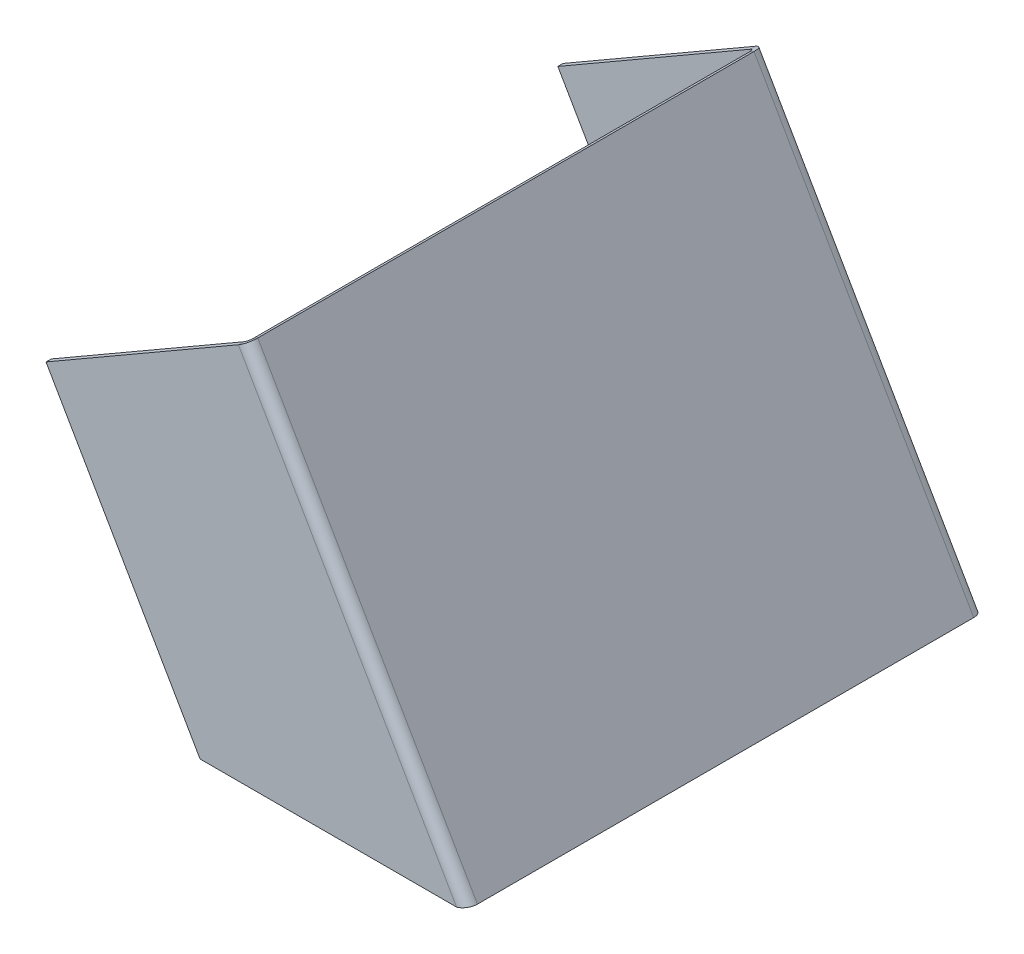
ISO-10303-21;
HEADER;
FILE_DESCRIPTION(('STEP AP214'),'2;1');
FILE_NAME('part.step','',(''),(''),'','','');
FILE_SCHEMA(('AUTOMOTIVE_DESIGN { 1 0 10303 214 1 1 1 1 }'));
ENDSEC;
DATA;
#1=APPLICATION_CONTEXT('core data for automotive mechanical design processes');
#2=APPLICATION_PROTOCOL_DEFINITION('international standard','automotive_design',2000,#1);
#3=PRODUCT_CONTEXT('',#1,'mechanical');
#4=PRODUCT('Part','Part','',(#3));
#5=PRODUCT_RELATED_PRODUCT_CATEGORY('part','',(#4));
#6=PRODUCT_DEFINITION_FORMATION('','',#4);
#7=PRODUCT_DEFINITION_CONTEXT('part definition',#1,'design');
#8=PRODUCT_DEFINITION('design','',#6,#7);
#9=PRODUCT_DEFINITION_SHAPE('','',#8);
#10=(LENGTH_UNIT() NAMED_UNIT(*) SI_UNIT(.MILLI.,.METRE.));
#11=(NAMED_UNIT(*) PLANE_ANGLE_UNIT() SI_UNIT($,.RADIAN.));
#12=(NAMED_UNIT(*) SI_UNIT($,.STERADIAN.) SOLID_ANGLE_UNIT());
#13=UNCERTAINTY_MEASURE_WITH_UNIT(LENGTH_MEASURE(1.E-05),#10,'distance_accuracy_value','');
#14=(GEOMETRIC_REPRESENTATION_CONTEXT(3) GLOBAL_UNCERTAINTY_ASSIGNED_CONTEXT((#13)) GLOBAL_UNIT_ASSIGNED_CONTEXT((#10,
#11,#12)) REPRESENTATION_CONTEXT('',''));
#15=CARTESIAN_POINT('',(0.,0.,0.));
#16=DIRECTION('',(0.,0.,1.));
#17=DIRECTION('',(1.,0.,0.));
#18=AXIS2_PLACEMENT_3D('',#15,#16,#17);
#19=CARTESIAN_POINT('',(-479.416697508022,3129.49491924311,97.5));
#20=DIRECTION('',(-0.866025403784441,-0.499999999999996,0.));
#21=DIRECTION('',(-0.499999999999996,0.866025403784441,0.));
#22=AXIS2_PLACEMENT_3D('',#19,#20,#21);
#23=PLANE('',#22);
#24=DIRECTION('',(0.,0.,-1.));
#25=VECTOR('',#24,1.);
#26=CARTESIAN_POINT('',(-520.122824862242,3199.99999999999,97.5));
#27=LINE('',#26,#25);
#28=CARTESIAN_POINT('',(-520.122824862242,3199.99999999999,99.5));
#29=VERTEX_POINT('',#28);
#30=CARTESIAN_POINT('',(-520.122824862242,3199.99999999999,97.5));
#31=VERTEX_POINT('',#30);
#32=EDGE_CURVE('E11',#29,#31,#27,.T.);
#33=ORIENTED_EDGE('',*,*,#32,.F.);
#34=DIRECTION('',(-0.499999999999996,0.866025403784441,0.));
#35=VECTOR('',#34,1.);
#36=CARTESIAN_POINT('',(-479.416697508022,3129.49491924311,99.5));
#37=LINE('',#36,#35);
#38=CARTESIAN_POINT('',(-579.416697508022,3302.7,99.5));
#39=VERTEX_POINT('',#38);
#40=EDGE_CURVE('E134',#29,#39,#37,.T.);
#41=ORIENTED_EDGE('',*,*,#40,.T.);
#42=DIRECTION('',(0.,0.,-1.));
#43=VECTOR('',#42,1.);
#44=CARTESIAN_POINT('',(-579.416697508022,3302.7,97.5));
#45=LINE('',#44,#43);
#46=CARTESIAN_POINT('',(-579.416697508022,3302.7,97.5));
#47=VERTEX_POINT('',#46);
#48=EDGE_CURVE('E50',#39,#47,#45,.T.);
#49=ORIENTED_EDGE('',*,*,#48,.T.);
#50=DIRECTION('',(-0.499999999999996,0.866025403784441,0.));
#51=VECTOR('',#50,1.);
#52=CARTESIAN_POINT('',(-479.416697508022,3129.49491924311,97.5));
#53=LINE('',#52,#51);
#54=EDGE_CURVE('E195',#31,#47,#53,.T.);
#55=ORIENTED_EDGE('',*,*,#54,.F.);
#56=EDGE_LOOP('',(#33,#41,#49,#55));
#57=FACE_BOUND('',#56,.T.);
#58=ADVANCED_FACE('F40',(#57),#23,.T.);
#59=CARTESIAN_POINT('',(-501.907423869314,3347.45,97.5));
#60=DIRECTION('',(-0.499999999999996,0.866025403784441,0.));
#61=DIRECTION('',(0.866025403784441,0.499999999999996,0.));
#62=AXIS2_PLACEMENT_3D('',#59,#60,#61);
#63=PLANE('',#62);
#64=ORIENTED_EDGE('',*,*,#48,.F.);
#65=DIRECTION('',(0.866025403784441,0.499999999999996,0.));
#66=VECTOR('',#65,1.);
#67=CARTESIAN_POINT('',(-501.907423869314,3347.45,99.5));
#68=LINE('',#67,#66);
#69=CARTESIAN_POINT('',(-505.371525484452,3345.45,99.5));
#70=VERTEX_POINT('',#69);
#71=EDGE_CURVE('E139',#70,#39,#68,.F.);
#72=ORIENTED_EDGE('',*,*,#71,.F.);
#73=DIRECTION('',(0.,0.,-1.));
#74=VECTOR('',#73,1.);
#75=CARTESIAN_POINT('',(-505.371525484452,3345.45,97.5));
#76=LINE('',#75,#74);
#77=CARTESIAN_POINT('',(-505.371525484452,3345.45,97.5));
#78=VERTEX_POINT('',#77);
#79=EDGE_CURVE('E58',#70,#78,#76,.T.);
#80=ORIENTED_EDGE('',*,*,#79,.T.);
#81=DIRECTION('',(0.866025403784441,0.499999999999996,0.));
#82=VECTOR('',#81,1.);
#83=CARTESIAN_POINT('',(-501.907423869314,3347.45,97.5));
#84=LINE('',#83,#82);
#85=EDGE_CURVE('E198',#78,#47,#84,.F.);
#86=ORIENTED_EDGE('',*,*,#85,.T.);
#87=EDGE_LOOP('',(#64,#72,#80,#86));
#88=FACE_BOUND('',#87,.T.);
#89=ADVANCED_FACE('F201',(#88),#63,.T.);
#90=CARTESIAN_POINT('',(-505.371525484452,3345.45,95.5));
#91=DIRECTION('',(0.499999999999996,-0.866025403784441,0.));
#92=DIRECTION('',(0.866025403784441,0.499999999999996,0.));
#93=AXIS2_PLACEMENT_3D('',#90,#91,#92);
#94=PLANE('',#93);
#95=ORIENTED_EDGE('',*,*,#79,.F.);
#96=CARTESIAN_POINT('',(-505.371525484452,3345.45,95.5));
#97=DIRECTION('',(-0.499999999999996,0.866025403784441,0.));
#98=DIRECTION('',(-0.866025403784441,-0.499999999999996,0.));
#99=AXIS2_PLACEMENT_3D('',#96,#97,#98);
#100=CIRCLE('',#99,4.);
#101=CARTESIAN_POINT('',(-501.907423869314,3347.45,95.5));
#102=VERTEX_POINT('',#101);
#103=EDGE_CURVE('E128',#102,#70,#100,.F.);
#104=ORIENTED_EDGE('',*,*,#103,.F.);
#105=DIRECTION('',(-0.866025403784441,-0.499999999999996,0.));
#106=VECTOR('',#105,1.);
#107=CARTESIAN_POINT('',(-503.639474676883,3346.45,95.5));
#108=LINE('',#107,#106);
#109=CARTESIAN_POINT('',(-503.639474676883,3346.45,95.5));
#110=VERTEX_POINT('',#109);
#111=EDGE_CURVE('E190',#102,#110,#108,.T.);
#112=ORIENTED_EDGE('',*,*,#111,.T.);
#113=CARTESIAN_POINT('',(-505.371525484452,3345.45,95.5));
#114=DIRECTION('',(-0.499999999999996,0.866025403784441,0.));
#115=DIRECTION('',(0.866025403784441,0.499999999999996,0.));
#116=AXIS2_PLACEMENT_3D('',#113,#114,#115);
#117=CIRCLE('',#116,2.);
#118=EDGE_CURVE('E117',#110,#78,#117,.F.);
#119=ORIENTED_EDGE('',*,*,#118,.T.);
#120=EDGE_LOOP('',(#95,#104,#112,#119));
#121=FACE_BOUND('',#120,.T.);
#122=ADVANCED_FACE('F229',(#121),#94,.F.);
#123=CARTESIAN_POINT('',(-503.639474676883,3346.45,-99.5));
#124=DIRECTION('',(-0.499999999999996,0.866025403784441,0.));
#125=DIRECTION('',(0.,0.,-1.));
#126=AXIS2_PLACEMENT_3D('',#123,#124,#125);
#127=PLANE('',#126);
#128=ORIENTED_EDGE('',*,*,#111,.F.);
#129=DIRECTION('',(0.,0.,1.));
#130=VECTOR('',#129,1.);
#131=CARTESIAN_POINT('',(-501.907423869314,3347.45,-99.5));
#132=LINE('',#131,#130);
#133=CARTESIAN_POINT('',(-501.907423869314,3347.45,-95.5));
#134=VERTEX_POINT('',#133);
#135=EDGE_CURVE('E156',#134,#102,#132,.T.);
#136=ORIENTED_EDGE('',*,*,#135,.F.);
#137=DIRECTION('',(-0.866025403784443,-0.499999999999993,0.));
#138=VECTOR('',#137,1.);
#139=CARTESIAN_POINT('',(-503.639474676883,3346.45,-95.5));
#140=LINE('',#139,#138);
#141=CARTESIAN_POINT('',(-503.639474676883,3346.45,-95.5));
#142=VERTEX_POINT('',#141);
#143=EDGE_CURVE('E187',#134,#142,#140,.T.);
#144=ORIENTED_EDGE('',*,*,#143,.T.);
#145=DIRECTION('',(0.,0.,-1.));
#146=VECTOR('',#145,1.);
#147=CARTESIAN_POINT('',(-503.639474676883,3346.45,-99.5));
#148=LINE('',#147,#146);
#149=EDGE_CURVE('E226',#142,#110,#148,.F.);
#150=ORIENTED_EDGE('',*,*,#149,.T.);
#151=EDGE_LOOP('',(#128,#136,#144,#150));
#152=FACE_BOUND('',#151,.T.);
#153=ADVANCED_FACE('F221',(#152),#127,.T.);
#154=CARTESIAN_POINT('',(-505.371525484452,3345.45,-95.5));
#155=DIRECTION('',(0.499999999999996,-0.866025403784441,0.));
#156=DIRECTION('',(0.866025403784441,0.499999999999996,0.));
#157=AXIS2_PLACEMENT_3D('',#154,#155,#156);
#158=PLANE('',#157);
#159=ORIENTED_EDGE('',*,*,#143,.F.);
#160=CARTESIAN_POINT('',(-505.371525484452,3345.45,-95.5));
#161=DIRECTION('',(-0.499999999999996,0.866025403784441,0.));
#162=DIRECTION('',(-0.866025403784441,-0.499999999999996,0.));
#163=AXIS2_PLACEMENT_3D('',#160,#161,#162);
#164=CIRCLE('',#163,4.);
#165=CARTESIAN_POINT('',(-505.371525484452,3345.45,-99.5));
#166=VERTEX_POINT('',#165);
#167=EDGE_CURVE('E131',#166,#134,#164,.F.);
#168=ORIENTED_EDGE('',*,*,#167,.F.);
#169=DIRECTION('',(0.,0.,1.));
#170=VECTOR('',#169,1.);
#171=CARTESIAN_POINT('',(-505.371525484452,3345.45,-97.5));
#172=LINE('',#171,#170);
#173=CARTESIAN_POINT('',(-505.371525484452,3345.45,-97.5));
#174=VERTEX_POINT('',#173);
#175=EDGE_CURVE('E184',#166,#174,#172,.T.);
#176=ORIENTED_EDGE('',*,*,#175,.T.);
#177=CARTESIAN_POINT('',(-505.371525484452,3345.45,-95.5));
#178=DIRECTION('',(-0.499999999999996,0.866025403784441,0.));
#179=DIRECTION('',(0.866025403784441,0.499999999999996,0.));
#180=AXIS2_PLACEMENT_3D('',#177,#178,#179);
#181=CIRCLE('',#180,2.);
#182=EDGE_CURVE('E281',#174,#142,#181,.F.);
#183=ORIENTED_EDGE('',*,*,#182,.T.);
#184=EDGE_LOOP('',(#159,#168,#176,#183));
#185=FACE_BOUND('',#184,.T.);
#186=ADVANCED_FACE('F324',(#185),#158,.F.);
#187=CARTESIAN_POINT('',(-579.416697508022,3302.7,-97.5));
#188=DIRECTION('',(0.499999999999996,-0.866025403784441,0.));
#189=DIRECTION('',(0.866025403784441,0.499999999999996,0.));
#190=AXIS2_PLACEMENT_3D('',#187,#188,#189);
#191=PLANE('',#190);
#192=ORIENTED_EDGE('',*,*,#175,.F.);
#193=DIRECTION('',(0.866025403784441,0.499999999999996,0.));
#194=VECTOR('',#193,1.);
#195=CARTESIAN_POINT('',(-579.416697508022,3302.7,-99.5));
#196=LINE('',#195,#194);
#197=CARTESIAN_POINT('',(-579.416697508022,3302.7,-99.5));
#198=VERTEX_POINT('',#197);
#199=EDGE_CURVE('E163',#198,#166,#196,.T.);
#200=ORIENTED_EDGE('',*,*,#199,.F.);
#201=DIRECTION('',(0.,0.,1.));
#202=VECTOR('',#201,1.);
#203=CARTESIAN_POINT('',(-579.416697508022,3302.7,-97.5));
#204=LINE('',#203,#202);
#205=CARTESIAN_POINT('',(-579.416697508022,3302.7,-97.5));
#206=VERTEX_POINT('',#205);
#207=EDGE_CURVE('E181',#198,#206,#204,.T.);
#208=ORIENTED_EDGE('',*,*,#207,.T.);
#209=DIRECTION('',(0.866025403784441,0.499999999999996,0.));
#210=VECTOR('',#209,1.);
#211=CARTESIAN_POINT('',(-579.416697508022,3302.7,-97.5));
#212=LINE('',#211,#210);
#213=EDGE_CURVE('E261',#206,#174,#212,.T.);
#214=ORIENTED_EDGE('',*,*,#213,.T.);
#215=EDGE_LOOP('',(#192,#200,#208,#214));
#216=FACE_BOUND('',#215,.T.);
#217=ADVANCED_FACE('F302',(#216),#191,.F.);
#218=CARTESIAN_POINT('',(-479.416697508022,3129.49491924311,-97.5));
#219=DIRECTION('',(0.866025403784441,0.499999999999996,0.));
#220=DIRECTION('',(-0.499999999999996,0.866025403784441,0.));
#221=AXIS2_PLACEMENT_3D('',#218,#219,#220);
#222=PLANE('',#221);
#223=ORIENTED_EDGE('',*,*,#207,.F.);
#224=DIRECTION('',(-0.499999999999996,0.866025403784441,0.));
#225=VECTOR('',#224,1.);
#226=CARTESIAN_POINT('',(-479.416697508022,3129.49491924311,-99.5));
#227=LINE('',#226,#225);
#228=CARTESIAN_POINT('',(-520.122824862242,3199.99999999999,-99.5));
#229=VERTEX_POINT('',#228);
#230=EDGE_CURVE('E160',#229,#198,#227,.T.);
#231=ORIENTED_EDGE('',*,*,#230,.F.);
#232=DIRECTION('',(0.,0.,1.));
#233=VECTOR('',#232,1.);
#234=CARTESIAN_POINT('',(-520.122824862242,3199.99999999999,-97.5));
#235=LINE('',#234,#233);
#236=CARTESIAN_POINT('',(-520.122824862242,3199.99999999999,-97.5));
#237=VERTEX_POINT('',#236);
#238=EDGE_CURVE('E178',#229,#237,#235,.T.);
#239=ORIENTED_EDGE('',*,*,#238,.T.);
#240=DIRECTION('',(-0.499999999999996,0.866025403784441,0.));
#241=VECTOR('',#240,1.);
#242=CARTESIAN_POINT('',(-479.416697508022,3129.49491924311,-97.5));
#243=LINE('',#242,#241);
#244=EDGE_CURVE('E141',#237,#206,#243,.T.);
#245=ORIENTED_EDGE('',*,*,#244,.T.);
#246=EDGE_LOOP('',(#223,#231,#239,#245));
#247=FACE_BOUND('',#246,.T.);
#248=ADVANCED_FACE('F249',(#247),#222,.F.);
#249=CARTESIAN_POINT('',(-479.416697508022,3199.99999999999,-97.5));
#250=DIRECTION('',(0.,-1.,0.));
#251=DIRECTION('',(1.,0.,0.));
#252=AXIS2_PLACEMENT_3D('',#249,#250,#251);
#253=PLANE('',#252);
#254=ORIENTED_EDGE('',*,*,#238,.F.);
#255=DIRECTION('',(1.,0.,0.));
#256=VECTOR('',#255,1.);
#257=CARTESIAN_POINT('',(-479.416697508022,3199.99999999999,-99.5));
#258=LINE('',#257,#256);
#259=CARTESIAN_POINT('',(-421.395928830816,3199.99999999999,-99.5));
#260=VERTEX_POINT('',#259);
#261=EDGE_CURVE('E157',#260,#229,#258,.F.);
#262=ORIENTED_EDGE('',*,*,#261,.F.);
#263=DIRECTION('',(0.,0.,1.));
#264=VECTOR('',#263,1.);
#265=CARTESIAN_POINT('',(-421.395928830816,3199.99999999999,-97.5));
#266=LINE('',#265,#264);
#267=CARTESIAN_POINT('',(-421.395928830816,3199.99999999999,-97.5));
#268=VERTEX_POINT('',#267);
#269=EDGE_CURVE('E175',#260,#268,#266,.T.);
#270=ORIENTED_EDGE('',*,*,#269,.T.);
#271=DIRECTION('',(1.,0.,0.));
#272=VECTOR('',#271,1.);
#273=CARTESIAN_POINT('',(-479.416697508022,3199.99999999999,-97.5));
#274=LINE('',#273,#272);
#275=EDGE_CURVE('E258',#268,#237,#274,.F.);
#276=ORIENTED_EDGE('',*,*,#275,.T.);
#277=EDGE_LOOP('',(#254,#262,#270,#276));
#278=FACE_BOUND('',#277,.T.);
#279=ADVANCED_FACE('F263',(#278),#253,.T.);
#280=CARTESIAN_POINT('',(-423.705329907575,3199.99999999999,-95.5));
#281=CARTESIAN_POINT('',(-424.282680176764,3199.66666666666,-95.5));
#282=CARTESIAN_POINT('',(-424.860030445954,3199.33333333332,-95.5));
#283=CARTESIAN_POINT('',(-425.437380715144,3198.99999999999,-95.5));
#284=CARTESIAN_POINT('',(-423.705329907575,3199.99999999999,-91.5));
#285=CARTESIAN_POINT('',(-424.282680176764,3199.66666666666,-90.1666666666667));
#286=CARTESIAN_POINT('',(-424.860030445954,3199.33333333333,-88.8333333333333));
#287=CARTESIAN_POINT('',(-425.437380715144,3198.99999999999,-87.5));
#288=CARTESIAN_POINT('',(-419.086527754058,3199.99999999999,-91.5));
#289=CARTESIAN_POINT('',(-418.509177484868,3200.33333333332,-90.1666666666667));
#290=CARTESIAN_POINT('',(-417.931827215678,3200.66666666666,-88.8333333333333));
#291=CARTESIAN_POINT('',(-417.354476946489,3200.99999999999,-87.5));
#292=CARTESIAN_POINT('',(-419.086527754058,3199.99999999999,-95.5));
#293=CARTESIAN_POINT('',(-418.509177484868,3200.33333333332,-95.5));
#294=CARTESIAN_POINT('',(-417.931827215678,3200.66666666666,-95.5));
#295=CARTESIAN_POINT('',(-417.354476946489,3200.99999999999,-95.5));
#296=CARTESIAN_POINT('',(-419.086527754058,3199.99999999999,-99.5));
#297=CARTESIAN_POINT('',(-418.509177484868,3200.33333333332,-100.833333333333));
#298=CARTESIAN_POINT('',(-417.931827215678,3200.66666666666,-102.166666666667));
#299=CARTESIAN_POINT('',(-417.354476946489,3200.99999999999,-103.5));
#300=CARTESIAN_POINT('',(-423.705329907575,3199.99999999999,-99.5));
#301=CARTESIAN_POINT('',(-424.282680176764,3199.66666666666,-100.833333333333));
#302=CARTESIAN_POINT('',(-424.860030445954,3199.33333333333,-102.166666666667));
#303=CARTESIAN_POINT('',(-425.437380715144,3198.99999999999,-103.5));
#304=CARTESIAN_POINT('',(-423.705329907575,3199.99999999999,-95.5));
#305=CARTESIAN_POINT('',(-424.282680176764,3199.66666666666,-95.5));
#306=CARTESIAN_POINT('',(-424.860030445954,3199.33333333332,-95.5));
#307=CARTESIAN_POINT('',(-425.437380715144,3198.99999999999,-95.5));
#308=(BOUNDED_SURFACE() B_SPLINE_SURFACE(3,3,((#280,#281,#282,#283),(#284,#285,#286,#287),(#288,
#289,#290,#291),(#292,#293,#294,#295),(#296,#297,#298,#299),(#300,#301,#302,#303),(#304,#305,
#306,#307)),.UNSPECIFIED.,.T.,.F.,.F.) B_SPLINE_SURFACE_WITH_KNOTS((4,3,4),(4,4),(0.,0.5,1.),
(0.,1.),.UNSPECIFIED.) GEOMETRIC_REPRESENTATION_ITEM() RATIONAL_B_SPLINE_SURFACE(((1.,1.,1.,1.),
(0.333333333333333,0.333333333333333,0.333333333333333,0.333333333333333),(0.333333333333333,
0.333333333333333,0.333333333333333,0.333333333333333),(1.,1.,1.,1.),(0.333333333333333,
0.333333333333333,0.333333333333333,0.333333333333333),(0.333333333333333,0.333333333333333,
0.333333333333333,0.333333333333333),(1.,1.,1.,1.))) REPRESENTATION_ITEM('') SURFACE());
#309=CARTESIAN_POINT('',(-421.395928830816,3199.99999999999,-95.5));
#310=DIRECTION('',(-0.240192230707601,0.970725343394159,0.));
#311=DIRECTION('',(-0.970725343394159,-0.240192230707601,0.));
#312=AXIS2_PLACEMENT_3D('',#309,#310,#311);
#313=ELLIPSE('',#312,4.16333199893233,4.);
#314=CARTESIAN_POINT('',(-417.354476946489,3200.99999999999,-95.5));
#315=VERTEX_POINT('',#314);
#316=EDGE_CURVE('E153',#315,#260,#313,.T.);
#317=DIRECTION('',(-0.866025403784441,-0.499999999999996,0.));
#318=VECTOR('',#317,1.);
#319=CARTESIAN_POINT('',(-419.086527754058,3199.99999999999,-95.5));
#320=LINE('',#319,#318);
#321=CARTESIAN_POINT('',(-419.086527754058,3199.99999999999,-95.5));
#322=VERTEX_POINT('',#321);
#323=EDGE_CURVE('E172',#315,#322,#320,.T.);
#324=CARTESIAN_POINT('',(-421.395928830816,3199.99999999999,-95.5));
#325=DIRECTION('',(0.,1.,0.));
#326=DIRECTION('',(-1.,0.,0.));
#327=AXIS2_PLACEMENT_3D('',#324,#325,#326);
#328=ELLIPSE('',#327,2.3094010767585,2.);
#329=EDGE_CURVE('E279',#322,#268,#328,.T.);
#330=ORIENTED_EDGE('',*,*,#269,.F.);
#331=ORIENTED_EDGE('',*,*,#316,.F.);
#332=ORIENTED_EDGE('',*,*,#323,.T.);
#333=ORIENTED_EDGE('',*,*,#329,.T.);
#334=EDGE_LOOP('',(#330,#331,#332,#333));
#335=FACE_BOUND('',#334,.T.);
#336=ADVANCED_FACE('F296',(#335),#308,.T.);
#337=CARTESIAN_POINT('',(-419.086527754058,3199.99999999999,-99.5));
#338=DIRECTION('',(-0.499999999999996,0.866025403784441,0.));
#339=DIRECTION('',(0.,0.,-1.));
#340=AXIS2_PLACEMENT_3D('',#337,#338,#339);
#341=PLANE('',#340);
#342=ORIENTED_EDGE('',*,*,#323,.F.);
#343=DIRECTION('',(0.,0.,1.));
#344=VECTOR('',#343,1.);
#345=CARTESIAN_POINT('',(-417.354476946489,3200.99999999999,-99.5));
#346=LINE('',#345,#344);
#347=CARTESIAN_POINT('',(-417.354476946489,3200.99999999999,95.5));
#348=VERTEX_POINT('',#347);
#349=EDGE_CURVE('E148',#348,#315,#346,.F.);
#350=ORIENTED_EDGE('',*,*,#349,.F.);
#351=DIRECTION('',(-0.866025403784441,-0.499999999999996,0.));
#352=VECTOR('',#351,1.);
#353=CARTESIAN_POINT('',(-419.086527754058,3199.99999999999,95.5));
#354=LINE('',#353,#352);
#355=CARTESIAN_POINT('',(-419.086527754058,3199.99999999999,95.5));
#356=VERTEX_POINT('',#355);
#357=EDGE_CURVE('E116',#348,#356,#354,.T.);
#358=ORIENTED_EDGE('',*,*,#357,.T.);
#359=DIRECTION('',(0.,0.,-1.));
#360=VECTOR('',#359,1.);
#361=CARTESIAN_POINT('',(-419.086527754058,3199.99999999999,-99.5));
#362=LINE('',#361,#360);
#363=EDGE_CURVE('E272',#356,#322,#362,.T.);
#364=ORIENTED_EDGE('',*,*,#363,.T.);
#365=EDGE_LOOP('',(#342,#350,#358,#364));
#366=FACE_BOUND('',#365,.T.);
#367=ADVANCED_FACE('F293',(#366),#341,.F.);
#368=CARTESIAN_POINT('',(-423.705329907575,3199.99999999999,95.5));
#369=CARTESIAN_POINT('',(-424.282680176764,3199.66666666666,95.5));
#370=CARTESIAN_POINT('',(-424.860030445954,3199.33333333332,95.5));
#371=CARTESIAN_POINT('',(-425.437380715144,3198.99999999999,95.5));
#372=CARTESIAN_POINT('',(-423.705329907575,3199.99999999999,99.5));
#373=CARTESIAN_POINT('',(-424.282680176764,3199.66666666666,100.833333333333));
#374=CARTESIAN_POINT('',(-424.860030445954,3199.33333333333,102.166666666667));
#375=CARTESIAN_POINT('',(-425.437380715144,3198.99999999999,103.5));
#376=CARTESIAN_POINT('',(-419.086527754058,3199.99999999999,99.5));
#377=CARTESIAN_POINT('',(-418.509177484868,3200.33333333332,100.833333333333));
#378=CARTESIAN_POINT('',(-417.931827215678,3200.66666666666,102.166666666667));
#379=CARTESIAN_POINT('',(-417.354476946489,3200.99999999999,103.5));
#380=CARTESIAN_POINT('',(-419.086527754058,3199.99999999999,95.5));
#381=CARTESIAN_POINT('',(-418.509177484868,3200.33333333332,95.5));
#382=CARTESIAN_POINT('',(-417.931827215678,3200.66666666666,95.5));
#383=CARTESIAN_POINT('',(-417.354476946489,3200.99999999999,95.5));
#384=CARTESIAN_POINT('',(-419.086527754058,3199.99999999999,91.5));
#385=CARTESIAN_POINT('',(-418.509177484868,3200.33333333332,90.1666666666667));
#386=CARTESIAN_POINT('',(-417.931827215678,3200.66666666666,88.8333333333333));
#387=CARTESIAN_POINT('',(-417.354476946489,3200.99999999999,87.5));
#388=CARTESIAN_POINT('',(-423.705329907575,3199.99999999999,91.5));
#389=CARTESIAN_POINT('',(-424.282680176764,3199.66666666666,90.1666666666667));
#390=CARTESIAN_POINT('',(-424.860030445954,3199.33333333333,88.8333333333333));
#391=CARTESIAN_POINT('',(-425.437380715144,3198.99999999999,87.5));
#392=CARTESIAN_POINT('',(-423.705329907575,3199.99999999999,95.5));
#393=CARTESIAN_POINT('',(-424.282680176764,3199.66666666666,95.5));
#394=CARTESIAN_POINT('',(-424.860030445954,3199.33333333332,95.5));
#395=CARTESIAN_POINT('',(-425.437380715144,3198.99999999999,95.5));
#396=(BOUNDED_SURFACE() B_SPLINE_SURFACE(3,3,((#368,#369,#370,#371),(#372,#373,#374,#375),(#376,
#377,#378,#379),(#380,#381,#382,#383),(#384,#385,#386,#387),(#388,#389,#390,#391),(#392,#393,
#394,#395)),.UNSPECIFIED.,.T.,.F.,.F.) B_SPLINE_SURFACE_WITH_KNOTS((4,3,4),(4,4),(0.,0.5,1.),
(0.,1.),.UNSPECIFIED.) GEOMETRIC_REPRESENTATION_ITEM() RATIONAL_B_SPLINE_SURFACE(((1.,1.,1.,1.),
(0.333333333333333,0.333333333333333,0.333333333333333,0.333333333333333),(0.333333333333333,
0.333333333333333,0.333333333333333,0.333333333333333),(1.,1.,1.,1.),(0.333333333333333,
0.333333333333333,0.333333333333333,0.333333333333333),(0.333333333333333,0.333333333333333,
0.333333333333333,0.333333333333333),(1.,1.,1.,1.))) REPRESENTATION_ITEM('') SURFACE());
#397=CARTESIAN_POINT('',(-421.395928830816,3199.99999999999,95.5));
#398=DIRECTION('',(-0.240192230707601,0.970725343394159,0.));
#399=DIRECTION('',(-0.970725343394159,-0.240192230707601,0.));
#400=AXIS2_PLACEMENT_3D('',#397,#398,#399);
#401=ELLIPSE('',#400,4.16333199893233,4.);
#402=CARTESIAN_POINT('',(-421.395928830816,3199.99999999999,99.5));
#403=VERTEX_POINT('',#402);
#404=EDGE_CURVE('E125',#403,#348,#401,.T.);
#405=DIRECTION('',(0.,0.,-1.));
#406=VECTOR('',#405,1.);
#407=CARTESIAN_POINT('',(-421.395928830816,3199.99999999999,97.5));
#408=LINE('',#407,#406);
#409=CARTESIAN_POINT('',(-421.395928830816,3199.99999999999,97.5));
#410=VERTEX_POINT('',#409);
#411=EDGE_CURVE('E44',#403,#410,#408,.T.);
#412=CARTESIAN_POINT('',(-421.395928830816,3199.99999999999,95.5));
#413=DIRECTION('',(0.,1.,0.));
#414=DIRECTION('',(-1.,0.,0.));
#415=AXIS2_PLACEMENT_3D('',#412,#413,#414);
#416=ELLIPSE('',#415,2.3094010767585,2.);
#417=EDGE_CURVE('E202',#410,#356,#416,.T.);
#418=ORIENTED_EDGE('',*,*,#357,.F.);
#419=ORIENTED_EDGE('',*,*,#404,.F.);
#420=ORIENTED_EDGE('',*,*,#411,.T.);
#421=ORIENTED_EDGE('',*,*,#417,.T.);
#422=EDGE_LOOP('',(#418,#419,#420,#421));
#423=FACE_BOUND('',#422,.T.);
#424=ADVANCED_FACE('F136',(#423),#396,.T.);
#425=CARTESIAN_POINT('',(-401.907423869315,3199.99999999999,97.5));
#426=DIRECTION('',(0.,-1.,0.));
#427=DIRECTION('',(-1.,0.,0.));
#428=AXIS2_PLACEMENT_3D('',#425,#426,#427);
#429=PLANE('',#428);
#430=DIRECTION('',(-1.,0.,0.));
#431=VECTOR('',#430,1.);
#432=CARTESIAN_POINT('',(-401.907423869315,3199.99999999999,99.5));
#433=LINE('',#432,#431);
#434=EDGE_CURVE('E107',#403,#29,#433,.T.);
#435=ORIENTED_EDGE('',*,*,#434,.T.);
#436=ORIENTED_EDGE('',*,*,#32,.T.);
#437=DIRECTION('',(-1.,0.,0.));
#438=VECTOR('',#437,1.);
#439=CARTESIAN_POINT('',(-401.907423869315,3199.99999999999,97.5));
#440=LINE('',#439,#438);
#441=EDGE_CURVE('E110',#410,#31,#440,.T.);
#442=ORIENTED_EDGE('',*,*,#441,.F.);
#443=ORIENTED_EDGE('',*,*,#411,.F.);
#444=EDGE_LOOP('',(#435,#436,#442,#443));
#445=FACE_BOUND('',#444,.T.);
#446=ADVANCED_FACE('F42',(#445),#429,.T.);
#447=CARTESIAN_POINT('',(-405.371525484452,3172.24491924311,95.5));
#448=DIRECTION('',(-0.499999999999996,0.866025403784441,0.));
#449=DIRECTION('',(-0.866025403784441,-0.499999999999996,0.));
#450=AXIS2_PLACEMENT_3D('',#447,#448,#449);
#451=CYLINDRICAL_SURFACE('',#450,2.);
#452=DIRECTION('',(-0.499999999999996,0.866025403784441,0.));
#453=VECTOR('',#452,1.);
#454=CARTESIAN_POINT('',(-403.639474676884,3173.24491924311,95.5));
#455=LINE('',#454,#453);
#456=EDGE_CURVE('E275',#356,#110,#455,.T.);
#457=ORIENTED_EDGE('',*,*,#456,.F.);
#458=ORIENTED_EDGE('',*,*,#417,.F.);
#459=DIRECTION('',(-0.499999999999996,0.866025403784441,0.));
#460=VECTOR('',#459,1.);
#461=CARTESIAN_POINT('',(-405.371525484452,3172.24491924311,97.5));
#462=LINE('',#461,#460);
#463=EDGE_CURVE('E284',#410,#78,#462,.T.);
#464=ORIENTED_EDGE('',*,*,#463,.T.);
#465=ORIENTED_EDGE('',*,*,#118,.F.);
#466=EDGE_LOOP('',(#457,#458,#464,#465));
#467=FACE_BOUND('',#466,.T.);
#468=ADVANCED_FACE('F287',(#467),#451,.F.);
#469=CARTESIAN_POINT('',(-401.907423869315,3174.24491924311,97.5));
#470=DIRECTION('',(0.,0.,-1.));
#471=DIRECTION('',(-1.,0.,0.));
#472=AXIS2_PLACEMENT_3D('',#469,#470,#471);
#473=PLANE('',#472);
#474=ORIENTED_EDGE('',*,*,#463,.F.);
#475=ORIENTED_EDGE('',*,*,#441,.T.);
#476=ORIENTED_EDGE('',*,*,#54,.T.);
#477=ORIENTED_EDGE('',*,*,#85,.F.);
#478=EDGE_LOOP('',(#474,#475,#476,#477));
#479=FACE_BOUND('',#478,.T.);
#480=ADVANCED_FACE('F197',(#479),#473,.T.);
#481=CARTESIAN_POINT('',(-405.371525484452,3172.24491924311,-95.5));
#482=DIRECTION('',(-0.499999999999996,0.866025403784441,0.));
#483=DIRECTION('',(-0.866025403784441,-0.499999999999996,0.));
#484=AXIS2_PLACEMENT_3D('',#481,#482,#483);
#485=CYLINDRICAL_SURFACE('',#484,2.);
#486=DIRECTION('',(-0.499999999999996,0.866025403784441,0.));
#487=VECTOR('',#486,1.);
#488=CARTESIAN_POINT('',(-405.371525484452,3172.24491924311,-97.5));
#489=LINE('',#488,#487);
#490=EDGE_CURVE('E264',#268,#174,#489,.T.);
#491=ORIENTED_EDGE('',*,*,#490,.F.);
#492=ORIENTED_EDGE('',*,*,#329,.F.);
#493=DIRECTION('',(-0.499999999999996,0.866025403784441,0.));
#494=VECTOR('',#493,1.);
#495=CARTESIAN_POINT('',(-403.639474676884,3173.24491924311,-95.5));
#496=LINE('',#495,#494);
#497=EDGE_CURVE('E269',#322,#142,#496,.T.);
#498=ORIENTED_EDGE('',*,*,#497,.T.);
#499=ORIENTED_EDGE('',*,*,#182,.F.);
#500=EDGE_LOOP('',(#491,#492,#498,#499));
#501=FACE_BOUND('',#500,.T.);
#502=ADVANCED_FACE('F299',(#501),#485,.F.);
#503=CARTESIAN_POINT('',(-403.639474676884,3173.24491924311,-99.5));
#504=DIRECTION('',(-0.866025403784441,-0.499999999999996,0.));
#505=DIRECTION('',(0.499999999999996,-0.866025403784441,0.));
#506=AXIS2_PLACEMENT_3D('',#503,#504,#505);
#507=PLANE('',#506);
#508=ORIENTED_EDGE('',*,*,#497,.F.);
#509=ORIENTED_EDGE('',*,*,#363,.F.);
#510=ORIENTED_EDGE('',*,*,#456,.T.);
#511=ORIENTED_EDGE('',*,*,#149,.F.);
#512=EDGE_LOOP('',(#508,#509,#510,#511));
#513=FACE_BOUND('',#512,.T.);
#514=ADVANCED_FACE('F291',(#513),#507,.T.);
#515=CARTESIAN_POINT('',(-479.416697508022,3129.49491924311,-97.5));
#516=DIRECTION('',(0.,0.,1.));
#517=DIRECTION('',(1.,0.,0.));
#518=AXIS2_PLACEMENT_3D('',#515,#516,#517);
#519=PLANE('',#518);
#520=ORIENTED_EDGE('',*,*,#244,.F.);
#521=ORIENTED_EDGE('',*,*,#275,.F.);
#522=ORIENTED_EDGE('',*,*,#490,.T.);
#523=ORIENTED_EDGE('',*,*,#213,.F.);
#524=EDGE_LOOP('',(#520,#521,#522,#523));
#525=FACE_BOUND('',#524,.T.);
#526=ADVANCED_FACE('F256',(#525),#519,.T.);
#527=CARTESIAN_POINT('',(-405.371525484452,3172.24491924311,95.5));
#528=DIRECTION('',(-0.499999999999996,0.866025403784441,0.));
#529=DIRECTION('',(-0.866025403784441,-0.499999999999996,0.));
#530=AXIS2_PLACEMENT_3D('',#527,#528,#529);
#531=CYLINDRICAL_SURFACE('',#530,4.);
#532=DIRECTION('',(0.499999999999996,-0.866025403784441,0.));
#533=VECTOR('',#532,1.);
#534=CARTESIAN_POINT('',(-401.907423869315,3174.24491924311,95.5));
#535=LINE('',#534,#533);
#536=EDGE_CURVE('E151',#348,#102,#535,.F.);
#537=ORIENTED_EDGE('',*,*,#536,.T.);
#538=ORIENTED_EDGE('',*,*,#103,.T.);
#539=DIRECTION('',(-0.499999999999996,0.866025403784441,0.));
#540=VECTOR('',#539,1.);
#541=CARTESIAN_POINT('',(-405.371525484452,3172.24491924311,99.5));
#542=LINE('',#541,#540);
#543=EDGE_CURVE('E122',#403,#70,#542,.T.);
#544=ORIENTED_EDGE('',*,*,#543,.F.);
#545=ORIENTED_EDGE('',*,*,#404,.T.);
#546=EDGE_LOOP('',(#537,#538,#544,#545));
#547=FACE_BOUND('',#546,.T.);
#548=ADVANCED_FACE('F124',(#547),#531,.T.);
#549=CARTESIAN_POINT('',(-401.907423869315,3174.24491924311,99.5));
#550=DIRECTION('',(0.,0.,-1.));
#551=DIRECTION('',(-1.,0.,0.));
#552=AXIS2_PLACEMENT_3D('',#549,#550,#551);
#553=PLANE('',#552);
#554=ORIENTED_EDGE('',*,*,#543,.T.);
#555=ORIENTED_EDGE('',*,*,#71,.T.);
#556=ORIENTED_EDGE('',*,*,#40,.F.);
#557=ORIENTED_EDGE('',*,*,#434,.F.);
#558=EDGE_LOOP('',(#554,#555,#556,#557));
#559=FACE_BOUND('',#558,.T.);
#560=ADVANCED_FACE('F133',(#559),#553,.F.);
#561=CARTESIAN_POINT('',(-405.371525484452,3172.24491924311,-95.5));
#562=DIRECTION('',(-0.499999999999996,0.866025403784441,0.));
#563=DIRECTION('',(-0.866025403784441,-0.499999999999996,0.));
#564=AXIS2_PLACEMENT_3D('',#561,#562,#563);
#565=CYLINDRICAL_SURFACE('',#564,4.);
#566=DIRECTION('',(-0.499999999999996,0.866025403784441,0.));
#567=VECTOR('',#566,1.);
#568=CARTESIAN_POINT('',(-405.371525484452,3172.24491924311,-99.5));
#569=LINE('',#568,#567);
#570=EDGE_CURVE('E146',#260,#166,#569,.T.);
#571=ORIENTED_EDGE('',*,*,#570,.T.);
#572=ORIENTED_EDGE('',*,*,#167,.T.);
#573=DIRECTION('',(-0.499999999999996,0.866025403784441,0.));
#574=VECTOR('',#573,1.);
#575=CARTESIAN_POINT('',(-401.907423869315,3174.24491924311,-95.5));
#576=LINE('',#575,#574);
#577=EDGE_CURVE('E152',#315,#134,#576,.T.);
#578=ORIENTED_EDGE('',*,*,#577,.F.);
#579=ORIENTED_EDGE('',*,*,#316,.T.);
#580=EDGE_LOOP('',(#571,#572,#578,#579));
#581=FACE_BOUND('',#580,.T.);
#582=ADVANCED_FACE('F217',(#581),#565,.T.);
#583=CARTESIAN_POINT('',(-401.907423869315,3174.24491924311,-99.5));
#584=DIRECTION('',(-0.866025403784441,-0.499999999999996,0.));
#585=DIRECTION('',(0.499999999999996,-0.866025403784441,0.));
#586=AXIS2_PLACEMENT_3D('',#583,#584,#585);
#587=PLANE('',#586);
#588=ORIENTED_EDGE('',*,*,#577,.T.);
#589=ORIENTED_EDGE('',*,*,#135,.T.);
#590=ORIENTED_EDGE('',*,*,#536,.F.);
#591=ORIENTED_EDGE('',*,*,#349,.T.);
#592=EDGE_LOOP('',(#588,#589,#590,#591));
#593=FACE_BOUND('',#592,.T.);
#594=ADVANCED_FACE('F211',(#593),#587,.F.);
#595=CARTESIAN_POINT('',(-479.416697508022,3129.49491924311,-99.5));
#596=DIRECTION('',(0.,0.,1.));
#597=DIRECTION('',(1.,0.,0.));
#598=AXIS2_PLACEMENT_3D('',#595,#596,#597);
#599=PLANE('',#598);
#600=ORIENTED_EDGE('',*,*,#230,.T.);
#601=ORIENTED_EDGE('',*,*,#199,.T.);
#602=ORIENTED_EDGE('',*,*,#570,.F.);
#603=ORIENTED_EDGE('',*,*,#261,.T.);
#604=EDGE_LOOP('',(#600,#601,#602,#603));
#605=FACE_BOUND('',#604,.T.);
#606=ADVANCED_FACE('F305',(#605),#599,.F.);
#607=CLOSED_SHELL('',(#58,#89,#122,#153,#186,#217,#248,#279,#336,#367,#424,#446,#468,#480,#502,
#514,#526,#548,#560,#582,#594,#606));
#608=MANIFOLD_SOLID_BREP('B2',#607);
#609=ADVANCED_BREP_SHAPE_REPRESENTATION('',(#18,#608),#14);
#610=SHAPE_DEFINITION_REPRESENTATION(#9,#609);
ENDSEC;
END-ISO-10303-21;
